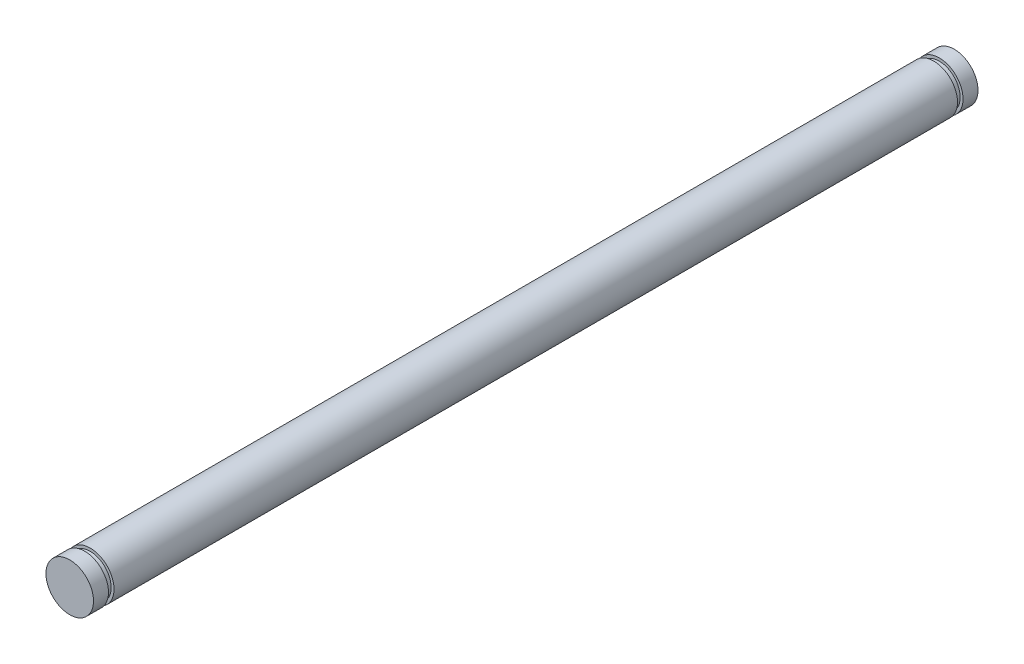
ISO-10303-21;
HEADER;
FILE_DESCRIPTION(('STEP AP214'),'2;1');
FILE_NAME('part.step','',(''),(''),'','','');
FILE_SCHEMA(('AUTOMOTIVE_DESIGN { 1 0 10303 214 1 1 1 1 }'));
ENDSEC;
DATA;
#1=APPLICATION_CONTEXT('core data for automotive mechanical design processes');
#2=APPLICATION_PROTOCOL_DEFINITION('international standard','automotive_design',2000,#1);
#3=PRODUCT_CONTEXT('',#1,'mechanical');
#4=PRODUCT('Part','Part','',(#3));
#5=PRODUCT_RELATED_PRODUCT_CATEGORY('part','',(#4));
#6=PRODUCT_DEFINITION_FORMATION('','',#4);
#7=PRODUCT_DEFINITION_CONTEXT('part definition',#1,'design');
#8=PRODUCT_DEFINITION('design','',#6,#7);
#9=PRODUCT_DEFINITION_SHAPE('','',#8);
#10=(LENGTH_UNIT() NAMED_UNIT(*) SI_UNIT(.MILLI.,.METRE.));
#11=(NAMED_UNIT(*) PLANE_ANGLE_UNIT() SI_UNIT($,.RADIAN.));
#12=(NAMED_UNIT(*) SI_UNIT($,.STERADIAN.) SOLID_ANGLE_UNIT());
#13=UNCERTAINTY_MEASURE_WITH_UNIT(LENGTH_MEASURE(1.E-05),#10,'distance_accuracy_value','');
#14=(GEOMETRIC_REPRESENTATION_CONTEXT(3) GLOBAL_UNCERTAINTY_ASSIGNED_CONTEXT((#13)) GLOBAL_UNIT_ASSIGNED_CONTEXT((#10,
#11,#12)) REPRESENTATION_CONTEXT('',''));
#15=CARTESIAN_POINT('',(0.,0.,0.));
#16=DIRECTION('',(0.,0.,1.));
#17=DIRECTION('',(1.,0.,0.));
#18=AXIS2_PLACEMENT_3D('',#15,#16,#17);
#19=CARTESIAN_POINT('',(0.,0.,56.32));
#20=DIRECTION('',(0.,0.,-1.));
#21=DIRECTION('',(-1.,0.,0.));
#22=AXIS2_PLACEMENT_3D('',#19,#20,#21);
#23=CYLINDRICAL_SURFACE('',#22,3.175);
#24=CARTESIAN_POINT('',(0.,0.,56.32));
#25=DIRECTION('',(0.,0.,1.));
#26=DIRECTION('',(1.,0.,0.));
#27=AXIS2_PLACEMENT_3D('',#24,#25,#26);
#28=CIRCLE('',#27,3.175);
#29=CARTESIAN_POINT('',(3.175,0.,56.32));
#30=VERTEX_POINT('',#29);
#31=EDGE_CURVE('E40',#30,#30,#28,.T.);
#32=ORIENTED_EDGE('',*,*,#31,.F.);
#33=EDGE_LOOP('',(#32));
#34=FACE_BOUND('',#33,.T.);
#35=CARTESIAN_POINT('',(0.,0.,-56.32));
#36=DIRECTION('',(0.,0.,1.));
#37=DIRECTION('',(1.,0.,0.));
#38=AXIS2_PLACEMENT_3D('',#35,#36,#37);
#39=CIRCLE('',#38,3.175);
#40=CARTESIAN_POINT('',(3.175,0.,-56.32));
#41=VERTEX_POINT('',#40);
#42=EDGE_CURVE('E59',#41,#41,#39,.T.);
#43=ORIENTED_EDGE('',*,*,#42,.T.);
#44=EDGE_LOOP('',(#43));
#45=FACE_BOUND('',#44,.T.);
#46=ADVANCED_FACE('F37',(#34,#45),#23,.T.);
#47=CARTESIAN_POINT('',(0.,0.,56.32));
#48=DIRECTION('',(0.,0.,1.));
#49=DIRECTION('',(1.,0.,0.));
#50=AXIS2_PLACEMENT_3D('',#47,#48,#49);
#51=PLANE('',#50);
#52=CARTESIAN_POINT('',(0.,0.,56.32));
#53=DIRECTION('',(0.,0.,1.));
#54=DIRECTION('',(1.,0.,0.));
#55=AXIS2_PLACEMENT_3D('',#52,#53,#54);
#56=CIRCLE('',#55,2.794);
#57=CARTESIAN_POINT('',(2.794,0.,56.32));
#58=VERTEX_POINT('',#57);
#59=EDGE_CURVE('E10',#58,#58,#56,.T.);
#60=ORIENTED_EDGE('',*,*,#59,.F.);
#61=EDGE_LOOP('',(#60));
#62=FACE_BOUND('',#61,.T.);
#63=ORIENTED_EDGE('',*,*,#31,.T.);
#64=EDGE_LOOP('',(#63));
#65=FACE_BOUND('',#64,.T.);
#66=ADVANCED_FACE('F99',(#62,#65),#51,.T.);
#67=CARTESIAN_POINT('',(0.,0.,57.0566));
#68=DIRECTION('',(0.,0.,-1.));
#69=DIRECTION('',(-1.,0.,0.));
#70=AXIS2_PLACEMENT_3D('',#67,#68,#69);
#71=CYLINDRICAL_SURFACE('',#70,2.794);
#72=CARTESIAN_POINT('',(0.,0.,57.0566));
#73=DIRECTION('',(0.,0.,1.));
#74=DIRECTION('',(1.,0.,0.));
#75=AXIS2_PLACEMENT_3D('',#72,#73,#74);
#76=CIRCLE('',#75,2.794);
#77=CARTESIAN_POINT('',(2.794,0.,57.0566));
#78=VERTEX_POINT('',#77);
#79=EDGE_CURVE('E49',#78,#78,#76,.T.);
#80=ORIENTED_EDGE('',*,*,#79,.F.);
#81=EDGE_LOOP('',(#80));
#82=FACE_BOUND('',#81,.T.);
#83=ORIENTED_EDGE('',*,*,#59,.T.);
#84=EDGE_LOOP('',(#83));
#85=FACE_BOUND('',#84,.T.);
#86=ADVANCED_FACE('F104',(#82,#85),#71,.T.);
#87=CARTESIAN_POINT('',(0.,0.,59.0566));
#88=DIRECTION('',(0.,0.,-1.));
#89=DIRECTION('',(-1.,0.,0.));
#90=AXIS2_PLACEMENT_3D('',#87,#88,#89);
#91=CYLINDRICAL_SURFACE('',#90,3.175);
#92=CARTESIAN_POINT('',(0.,0.,59.0566));
#93=DIRECTION('',(0.,0.,1.));
#94=DIRECTION('',(1.,0.,0.));
#95=AXIS2_PLACEMENT_3D('',#92,#93,#94);
#96=CIRCLE('',#95,3.175);
#97=CARTESIAN_POINT('',(3.175,0.,59.0566));
#98=VERTEX_POINT('',#97);
#99=EDGE_CURVE('E54',#98,#98,#96,.T.);
#100=ORIENTED_EDGE('',*,*,#99,.F.);
#101=EDGE_LOOP('',(#100));
#102=FACE_BOUND('',#101,.T.);
#103=CARTESIAN_POINT('',(0.,0.,57.0566));
#104=DIRECTION('',(0.,0.,1.));
#105=DIRECTION('',(1.,0.,0.));
#106=AXIS2_PLACEMENT_3D('',#103,#104,#105);
#107=CIRCLE('',#106,3.175);
#108=CARTESIAN_POINT('',(3.175,0.,57.0566));
#109=VERTEX_POINT('',#108);
#110=EDGE_CURVE('E55',#109,#109,#107,.T.);
#111=ORIENTED_EDGE('',*,*,#110,.T.);
#112=EDGE_LOOP('',(#111));
#113=FACE_BOUND('',#112,.T.);
#114=ADVANCED_FACE('F126',(#102,#113),#91,.T.);
#115=CARTESIAN_POINT('',(0.,0.,59.0566));
#116=DIRECTION('',(0.,0.,1.));
#117=DIRECTION('',(1.,0.,0.));
#118=AXIS2_PLACEMENT_3D('',#115,#116,#117);
#119=PLANE('',#118);
#120=ORIENTED_EDGE('',*,*,#99,.T.);
#121=EDGE_LOOP('',(#120));
#122=FACE_BOUND('',#121,.T.);
#123=ADVANCED_FACE('F121',(#122),#119,.T.);
#124=CARTESIAN_POINT('',(0.,0.,57.0566));
#125=DIRECTION('',(0.,0.,1.));
#126=DIRECTION('',(1.,0.,0.));
#127=AXIS2_PLACEMENT_3D('',#124,#125,#126);
#128=PLANE('',#127);
#129=ORIENTED_EDGE('',*,*,#79,.T.);
#130=EDGE_LOOP('',(#129));
#131=FACE_BOUND('',#130,.T.);
#132=ORIENTED_EDGE('',*,*,#110,.F.);
#133=EDGE_LOOP('',(#132));
#134=FACE_BOUND('',#133,.T.);
#135=ADVANCED_FACE('F112',(#131,#134),#128,.F.);
#136=CARTESIAN_POINT('',(0.,0.,-56.32));
#137=DIRECTION('',(0.,0.,-1.));
#138=DIRECTION('',(1.,0.,0.));
#139=AXIS2_PLACEMENT_3D('',#136,#137,#138);
#140=PLANE('',#139);
#141=CARTESIAN_POINT('',(0.,0.,-56.32));
#142=DIRECTION('',(0.,0.,1.));
#143=DIRECTION('',(1.,0.,0.));
#144=AXIS2_PLACEMENT_3D('',#141,#142,#143);
#145=CIRCLE('',#144,2.794);
#146=CARTESIAN_POINT('',(2.794,0.,-56.32));
#147=VERTEX_POINT('',#146);
#148=EDGE_CURVE('E66',#147,#147,#145,.T.);
#149=ORIENTED_EDGE('',*,*,#148,.T.);
#150=EDGE_LOOP('',(#149));
#151=FACE_BOUND('',#150,.T.);
#152=ORIENTED_EDGE('',*,*,#42,.F.);
#153=EDGE_LOOP('',(#152));
#154=FACE_BOUND('',#153,.T.);
#155=ADVANCED_FACE('F110',(#151,#154),#140,.T.);
#156=CARTESIAN_POINT('',(0.,0.,-57.0566));
#157=DIRECTION('',(0.,0.,1.));
#158=DIRECTION('',(1.,0.,0.));
#159=AXIS2_PLACEMENT_3D('',#156,#157,#158);
#160=CYLINDRICAL_SURFACE('',#159,2.794);
#161=CARTESIAN_POINT('',(0.,0.,-57.0566));
#162=DIRECTION('',(0.,0.,1.));
#163=DIRECTION('',(1.,0.,0.));
#164=AXIS2_PLACEMENT_3D('',#161,#162,#163);
#165=CIRCLE('',#164,2.794);
#166=CARTESIAN_POINT('',(2.794,0.,-57.0566));
#167=VERTEX_POINT('',#166);
#168=EDGE_CURVE('E70',#167,#167,#165,.T.);
#169=ORIENTED_EDGE('',*,*,#168,.T.);
#170=EDGE_LOOP('',(#169));
#171=FACE_BOUND('',#170,.T.);
#172=ORIENTED_EDGE('',*,*,#148,.F.);
#173=EDGE_LOOP('',(#172));
#174=FACE_BOUND('',#173,.T.);
#175=ADVANCED_FACE('F96',(#171,#174),#160,.T.);
#176=CARTESIAN_POINT('',(0.,0.,-59.0566));
#177=DIRECTION('',(0.,0.,1.));
#178=DIRECTION('',(1.,0.,0.));
#179=AXIS2_PLACEMENT_3D('',#176,#177,#178);
#180=CYLINDRICAL_SURFACE('',#179,3.175);
#181=CARTESIAN_POINT('',(0.,0.,-59.0566));
#182=DIRECTION('',(0.,0.,1.));
#183=DIRECTION('',(1.,0.,0.));
#184=AXIS2_PLACEMENT_3D('',#181,#182,#183);
#185=CIRCLE('',#184,3.175);
#186=CARTESIAN_POINT('',(3.175,0.,-59.0566));
#187=VERTEX_POINT('',#186);
#188=EDGE_CURVE('E74',#187,#187,#185,.T.);
#189=ORIENTED_EDGE('',*,*,#188,.T.);
#190=EDGE_LOOP('',(#189));
#191=FACE_BOUND('',#190,.T.);
#192=CARTESIAN_POINT('',(0.,0.,-57.0566));
#193=DIRECTION('',(0.,0.,1.));
#194=DIRECTION('',(1.,0.,0.));
#195=AXIS2_PLACEMENT_3D('',#192,#193,#194);
#196=CIRCLE('',#195,3.175);
#197=CARTESIAN_POINT('',(3.175,0.,-57.0566));
#198=VERTEX_POINT('',#197);
#199=EDGE_CURVE('E75',#198,#198,#196,.T.);
#200=ORIENTED_EDGE('',*,*,#199,.F.);
#201=EDGE_LOOP('',(#200));
#202=FACE_BOUND('',#201,.T.);
#203=ADVANCED_FACE('F83',(#191,#202),#180,.T.);
#204=CARTESIAN_POINT('',(0.,0.,-59.0566));
#205=DIRECTION('',(0.,0.,-1.));
#206=DIRECTION('',(1.,0.,0.));
#207=AXIS2_PLACEMENT_3D('',#204,#205,#206);
#208=PLANE('',#207);
#209=ORIENTED_EDGE('',*,*,#188,.F.);
#210=EDGE_LOOP('',(#209));
#211=FACE_BOUND('',#210,.T.);
#212=ADVANCED_FACE('F86',(#211),#208,.T.);
#213=CARTESIAN_POINT('',(0.,0.,-57.0566));
#214=DIRECTION('',(0.,0.,-1.));
#215=DIRECTION('',(1.,0.,0.));
#216=AXIS2_PLACEMENT_3D('',#213,#214,#215);
#217=PLANE('',#216);
#218=ORIENTED_EDGE('',*,*,#168,.F.);
#219=EDGE_LOOP('',(#218));
#220=FACE_BOUND('',#219,.T.);
#221=ORIENTED_EDGE('',*,*,#199,.T.);
#222=EDGE_LOOP('',(#221));
#223=FACE_BOUND('',#222,.T.);
#224=ADVANCED_FACE('F88',(#220,#223),#217,.F.);
#225=CLOSED_SHELL('',(#46,#66,#86,#114,#123,#135,#155,#175,#203,#212,#224));
#226=MANIFOLD_SOLID_BREP('B2',#225);
#227=ADVANCED_BREP_SHAPE_REPRESENTATION('',(#18,#226),#14);
#228=SHAPE_DEFINITION_REPRESENTATION(#9,#227);
ENDSEC;
END-ISO-10303-21;
